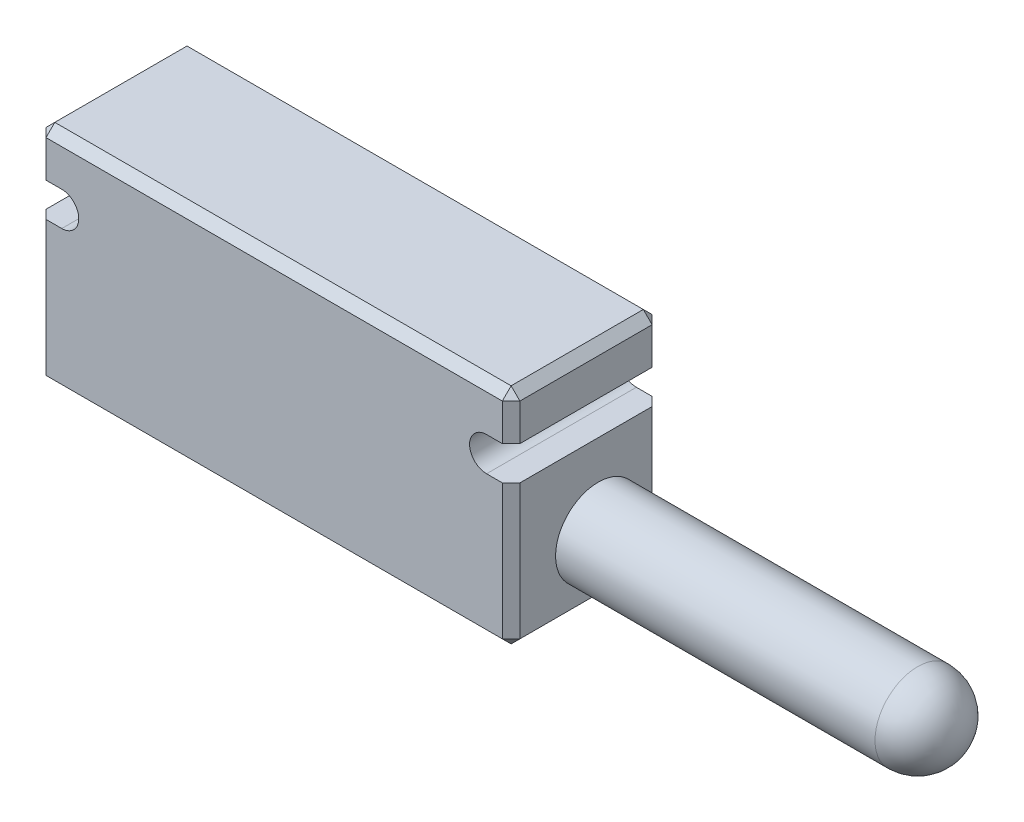
ISO-10303-21;
HEADER;
FILE_DESCRIPTION(('STEP AP214'),'2;1');
FILE_NAME('part.step','',(''),(''),'','','');
FILE_SCHEMA(('AUTOMOTIVE_DESIGN { 1 0 10303 214 1 1 1 1 }'));
ENDSEC;
DATA;
#1=APPLICATION_CONTEXT('core data for automotive mechanical design processes');
#2=APPLICATION_PROTOCOL_DEFINITION('international standard','automotive_design',2000,#1);
#3=PRODUCT_CONTEXT('',#1,'mechanical');
#4=PRODUCT('Part','Part','',(#3));
#5=PRODUCT_RELATED_PRODUCT_CATEGORY('part','',(#4));
#6=PRODUCT_DEFINITION_FORMATION('','',#4);
#7=PRODUCT_DEFINITION_CONTEXT('part definition',#1,'design');
#8=PRODUCT_DEFINITION('design','',#6,#7);
#9=PRODUCT_DEFINITION_SHAPE('','',#8);
#10=(LENGTH_UNIT() NAMED_UNIT(*) SI_UNIT(.MILLI.,.METRE.));
#11=(NAMED_UNIT(*) PLANE_ANGLE_UNIT() SI_UNIT($,.RADIAN.));
#12=(NAMED_UNIT(*) SI_UNIT($,.STERADIAN.) SOLID_ANGLE_UNIT());
#13=UNCERTAINTY_MEASURE_WITH_UNIT(LENGTH_MEASURE(1.E-05),#10,'distance_accuracy_value','');
#14=(GEOMETRIC_REPRESENTATION_CONTEXT(3) GLOBAL_UNCERTAINTY_ASSIGNED_CONTEXT((#13)) GLOBAL_UNIT_ASSIGNED_CONTEXT((#10,
#11,#12)) REPRESENTATION_CONTEXT('',''));
#15=CARTESIAN_POINT('',(0.,0.,0.));
#16=DIRECTION('',(0.,0.,1.));
#17=DIRECTION('',(1.,0.,0.));
#18=AXIS2_PLACEMENT_3D('',#15,#16,#17);
#19=CARTESIAN_POINT('',(-13.46,-6.35,-3.56));
#20=DIRECTION('',(-1.,0.,0.));
#21=DIRECTION('',(0.,0.,1.));
#22=AXIS2_PLACEMENT_3D('',#19,#20,#21);
#23=PLANE('',#22);
#24=DIRECTION('',(0.,0.,1.));
#25=VECTOR('',#24,1.);
#26=CARTESIAN_POINT('',(-13.46,1.825,-3.56));
#27=LINE('',#26,#25);
#28=CARTESIAN_POINT('',(-13.46,1.825,-3.06));
#29=VERTEX_POINT('',#28);
#30=CARTESIAN_POINT('',(-13.46,1.825,4.45));
#31=VERTEX_POINT('',#30);
#32=EDGE_CURVE('E230',#29,#31,#27,.T.);
#33=ORIENTED_EDGE('',*,*,#32,.F.);
#34=DIRECTION('',(0.,-1.,0.));
#35=VECTOR('',#34,1.);
#36=CARTESIAN_POINT('',(-13.46,-6.35,-3.06));
#37=LINE('',#36,#35);
#38=CARTESIAN_POINT('',(-13.46,-5.85,-3.06));
#39=VERTEX_POINT('',#38);
#40=EDGE_CURVE('E53',#29,#39,#37,.T.);
#41=ORIENTED_EDGE('',*,*,#40,.T.);
#42=DIRECTION('',(0.,0.,1.));
#43=VECTOR('',#42,1.);
#44=CARTESIAN_POINT('',(-13.46,-5.85,-3.56));
#45=LINE('',#44,#43);
#46=CARTESIAN_POINT('',(-13.46,-5.85,4.45));
#47=VERTEX_POINT('',#46);
#48=EDGE_CURVE('E57',#39,#47,#45,.T.);
#49=ORIENTED_EDGE('',*,*,#48,.T.);
#50=DIRECTION('',(0.,1.,0.));
#51=VECTOR('',#50,1.);
#52=CARTESIAN_POINT('',(-13.46,-6.35,4.45));
#53=LINE('',#52,#51);
#54=EDGE_CURVE('E328',#47,#31,#53,.T.);
#55=ORIENTED_EDGE('',*,*,#54,.T.);
#56=EDGE_LOOP('',(#33,#41,#49,#55));
#57=FACE_BOUND('',#56,.T.);
#58=ADVANCED_FACE('F36',(#57),#23,.T.);
#59=CARTESIAN_POINT('',(13.46,-6.35,-3.56));
#60=DIRECTION('',(1.,0.,0.));
#61=DIRECTION('',(0.,0.,-1.));
#62=AXIS2_PLACEMENT_3D('',#59,#60,#61);
#63=PLANE('',#62);
#64=DIRECTION('',(0.,0.,1.));
#65=VECTOR('',#64,1.);
#66=CARTESIAN_POINT('',(13.46,3.755,-3.56));
#67=LINE('',#66,#65);
#68=CARTESIAN_POINT('',(13.46,3.755,-3.06));
#69=VERTEX_POINT('',#68);
#70=CARTESIAN_POINT('',(13.46,3.755,4.45));
#71=VERTEX_POINT('',#70);
#72=EDGE_CURVE('E252',#69,#71,#67,.T.);
#73=ORIENTED_EDGE('',*,*,#72,.F.);
#74=DIRECTION('',(0.,1.,0.));
#75=VECTOR('',#74,1.);
#76=CARTESIAN_POINT('',(13.46,6.35,-3.06));
#77=LINE('',#76,#75);
#78=CARTESIAN_POINT('',(13.46,5.85,-3.06));
#79=VERTEX_POINT('',#78);
#80=EDGE_CURVE('E269',#69,#79,#77,.T.);
#81=ORIENTED_EDGE('',*,*,#80,.T.);
#82=DIRECTION('',(0.,0.,1.));
#83=VECTOR('',#82,1.);
#84=CARTESIAN_POINT('',(13.46,5.85,-3.56));
#85=LINE('',#84,#83);
#86=CARTESIAN_POINT('',(13.46,5.85,4.45));
#87=VERTEX_POINT('',#86);
#88=EDGE_CURVE('E266',#79,#87,#85,.T.);
#89=ORIENTED_EDGE('',*,*,#88,.T.);
#90=DIRECTION('',(0.,-1.,0.));
#91=VECTOR('',#90,1.);
#92=CARTESIAN_POINT('',(13.46,-6.35,4.45));
#93=LINE('',#92,#91);
#94=EDGE_CURVE('E264',#87,#71,#93,.T.);
#95=ORIENTED_EDGE('',*,*,#94,.T.);
#96=EDGE_LOOP('',(#73,#81,#89,#95));
#97=FACE_BOUND('',#96,.T.);
#98=ADVANCED_FACE('F466',(#97),#63,.T.);
#99=DIRECTION('',(0.,1.,0.));
#100=VECTOR('',#99,1.);
#101=CARTESIAN_POINT('',(-13.46,-6.35,4.45));
#102=LINE('',#101,#100);
#103=CARTESIAN_POINT('',(-13.46,3.755,4.45));
#104=VERTEX_POINT('',#103);
#105=CARTESIAN_POINT('',(-13.46,5.85,4.45));
#106=VERTEX_POINT('',#105);
#107=EDGE_CURVE('E294',#104,#106,#102,.T.);
#108=ORIENTED_EDGE('',*,*,#107,.T.);
#109=DIRECTION('',(0.,0.,-1.));
#110=VECTOR('',#109,1.);
#111=CARTESIAN_POINT('',(-13.46,5.85,-3.56));
#112=LINE('',#111,#110);
#113=CARTESIAN_POINT('',(-13.46,5.85,-3.56));
#114=VERTEX_POINT('',#113);
#115=EDGE_CURVE('E296',#106,#114,#112,.T.);
#116=ORIENTED_EDGE('',*,*,#115,.T.);
#117=DIRECTION('',(0.,-1.,0.));
#118=VECTOR('',#117,1.);
#119=CARTESIAN_POINT('',(-13.46,-6.35,-3.56));
#120=LINE('',#119,#118);
#121=CARTESIAN_POINT('',(-13.46,3.755,-3.56));
#122=VERTEX_POINT('',#121);
#123=EDGE_CURVE('E229',#114,#122,#120,.T.);
#124=ORIENTED_EDGE('',*,*,#123,.T.);
#125=DIRECTION('',(0.,0.,1.));
#126=VECTOR('',#125,1.);
#127=CARTESIAN_POINT('',(-13.46,3.755,-3.56));
#128=LINE('',#127,#126);
#129=EDGE_CURVE('E202',#122,#104,#128,.T.);
#130=ORIENTED_EDGE('',*,*,#129,.T.);
#131=EDGE_LOOP('',(#108,#116,#124,#130));
#132=FACE_BOUND('',#131,.T.);
#133=ADVANCED_FACE('F472',(#132),#23,.T.);
#134=CARTESIAN_POINT('',(13.46,6.35,-3.56));
#135=DIRECTION('',(0.,1.,0.));
#136=DIRECTION('',(-1.,0.,0.));
#137=AXIS2_PLACEMENT_3D('',#134,#135,#136);
#138=PLANE('',#137);
#139=DIRECTION('',(1.,0.,0.));
#140=VECTOR('',#139,1.);
#141=CARTESIAN_POINT('',(13.46,6.35,4.45));
#142=LINE('',#141,#140);
#143=CARTESIAN_POINT('',(-12.96,6.35,4.45));
#144=VERTEX_POINT('',#143);
#145=CARTESIAN_POINT('',(12.96,6.35,4.45));
#146=VERTEX_POINT('',#145);
#147=EDGE_CURVE('E271',#144,#146,#142,.T.);
#148=ORIENTED_EDGE('',*,*,#147,.T.);
#149=DIRECTION('',(0.,0.,-1.));
#150=VECTOR('',#149,1.);
#151=CARTESIAN_POINT('',(12.96,6.35,-3.56));
#152=LINE('',#151,#150);
#153=CARTESIAN_POINT('',(12.96,6.35,-3.06));
#154=VERTEX_POINT('',#153);
#155=EDGE_CURVE('E277',#146,#154,#152,.T.);
#156=ORIENTED_EDGE('',*,*,#155,.T.);
#157=DIRECTION('',(-1.,0.,0.));
#158=VECTOR('',#157,1.);
#159=CARTESIAN_POINT('',(-13.46,6.35,-3.06));
#160=LINE('',#159,#158);
#161=CARTESIAN_POINT('',(-12.96,6.35,-3.06));
#162=VERTEX_POINT('',#161);
#163=EDGE_CURVE('E275',#154,#162,#160,.T.);
#164=ORIENTED_EDGE('',*,*,#163,.T.);
#165=DIRECTION('',(0.,0.,1.));
#166=VECTOR('',#165,1.);
#167=CARTESIAN_POINT('',(-12.96,6.35,-3.56));
#168=LINE('',#167,#166);
#169=EDGE_CURVE('E273',#162,#144,#168,.T.);
#170=ORIENTED_EDGE('',*,*,#169,.T.);
#171=EDGE_LOOP('',(#148,#156,#164,#170));
#172=FACE_BOUND('',#171,.T.);
#173=ADVANCED_FACE('F463',(#172),#138,.T.);
#174=CARTESIAN_POINT('',(13.46,-2.79,0.));
#175=DIRECTION('',(1.,0.,0.));
#176=DIRECTION('',(0.,0.,-1.));
#177=AXIS2_PLACEMENT_3D('',#174,#175,#176);
#178=CIRCLE('',#177,2.425);
#179=CARTESIAN_POINT('',(13.46,-2.79,-2.425));
#180=VERTEX_POINT('',#179);
#181=EDGE_CURVE('E221',#180,#180,#178,.T.);
#182=ORIENTED_EDGE('',*,*,#181,.F.);
#183=EDGE_LOOP('',(#182));
#184=FACE_BOUND('',#183,.T.);
#185=DIRECTION('',(0.,0.,-1.));
#186=VECTOR('',#185,1.);
#187=CARTESIAN_POINT('',(13.46,-5.85,-3.56));
#188=LINE('',#187,#186);
#189=CARTESIAN_POINT('',(13.46,-5.85,4.45));
#190=VERTEX_POINT('',#189);
#191=CARTESIAN_POINT('',(13.46,-5.85,-3.06));
#192=VERTEX_POINT('',#191);
#193=EDGE_CURVE('E323',#190,#192,#188,.T.);
#194=ORIENTED_EDGE('',*,*,#193,.T.);
#195=DIRECTION('',(0.,1.,0.));
#196=VECTOR('',#195,1.);
#197=CARTESIAN_POINT('',(13.46,1.825,-3.06));
#198=LINE('',#197,#196);
#199=CARTESIAN_POINT('',(13.46,1.825,-3.06));
#200=VERTEX_POINT('',#199);
#201=EDGE_CURVE('E326',#192,#200,#198,.T.);
#202=ORIENTED_EDGE('',*,*,#201,.T.);
#203=DIRECTION('',(0.,0.,1.));
#204=VECTOR('',#203,1.);
#205=CARTESIAN_POINT('',(13.46,1.825,-3.56));
#206=LINE('',#205,#204);
#207=CARTESIAN_POINT('',(13.46,1.825,4.45));
#208=VERTEX_POINT('',#207);
#209=EDGE_CURVE('E255',#200,#208,#206,.T.);
#210=ORIENTED_EDGE('',*,*,#209,.T.);
#211=DIRECTION('',(0.,-1.,0.));
#212=VECTOR('',#211,1.);
#213=CARTESIAN_POINT('',(13.46,-6.35,4.45));
#214=LINE('',#213,#212);
#215=EDGE_CURVE('E321',#208,#190,#214,.T.);
#216=ORIENTED_EDGE('',*,*,#215,.T.);
#217=EDGE_LOOP('',(#194,#202,#210,#216));
#218=FACE_BOUND('',#217,.T.);
#219=ADVANCED_FACE('F461',(#184,#218),#63,.T.);
#220=CARTESIAN_POINT('',(13.46,-6.35,-3.56));
#221=DIRECTION('',(0.,-1.,0.));
#222=DIRECTION('',(1.,0.,0.));
#223=AXIS2_PLACEMENT_3D('',#220,#221,#222);
#224=PLANE('',#223);
#225=DIRECTION('',(1.,0.,0.));
#226=VECTOR('',#225,1.);
#227=CARTESIAN_POINT('',(13.46,-6.35,-3.06));
#228=LINE('',#227,#226);
#229=CARTESIAN_POINT('',(-12.96,-6.35,-3.06));
#230=VERTEX_POINT('',#229);
#231=CARTESIAN_POINT('',(12.96,-6.35,-3.06));
#232=VERTEX_POINT('',#231);
#233=EDGE_CURVE('E316',#230,#232,#228,.T.);
#234=ORIENTED_EDGE('',*,*,#233,.T.);
#235=DIRECTION('',(0.,0.,1.));
#236=VECTOR('',#235,1.);
#237=CARTESIAN_POINT('',(12.96,-6.35,-3.56));
#238=LINE('',#237,#236);
#239=CARTESIAN_POINT('',(12.96,-6.35,4.45));
#240=VERTEX_POINT('',#239);
#241=EDGE_CURVE('E318',#232,#240,#238,.T.);
#242=ORIENTED_EDGE('',*,*,#241,.T.);
#243=DIRECTION('',(-1.,0.,0.));
#244=VECTOR('',#243,1.);
#245=CARTESIAN_POINT('',(13.46,-6.35,4.45));
#246=LINE('',#245,#244);
#247=CARTESIAN_POINT('',(-12.96,-6.35,4.45));
#248=VERTEX_POINT('',#247);
#249=EDGE_CURVE('E312',#240,#248,#246,.T.);
#250=ORIENTED_EDGE('',*,*,#249,.T.);
#251=DIRECTION('',(0.,0.,-1.));
#252=VECTOR('',#251,1.);
#253=CARTESIAN_POINT('',(-12.96,-6.35,-3.56));
#254=LINE('',#253,#252);
#255=EDGE_CURVE('E314',#248,#230,#254,.T.);
#256=ORIENTED_EDGE('',*,*,#255,.T.);
#257=EDGE_LOOP('',(#234,#242,#250,#256));
#258=FACE_BOUND('',#257,.T.);
#259=ADVANCED_FACE('F410',(#258),#224,.T.);
#260=CARTESIAN_POINT('',(0.,0.,-3.56));
#261=DIRECTION('',(0.,0.,1.));
#262=DIRECTION('',(1.,0.,0.));
#263=AXIS2_PLACEMENT_3D('',#260,#261,#262);
#264=PLANE('',#263);
#265=DIRECTION('',(1.,0.,0.));
#266=VECTOR('',#265,1.);
#267=CARTESIAN_POINT('',(13.46,5.85,-3.56));
#268=LINE('',#267,#266);
#269=CARTESIAN_POINT('',(12.96,5.85,-3.56));
#270=VERTEX_POINT('',#269);
#271=EDGE_CURVE('E286',#114,#270,#268,.T.);
#272=ORIENTED_EDGE('',*,*,#271,.T.);
#273=DIRECTION('',(0.,-1.,0.));
#274=VECTOR('',#273,1.);
#275=CARTESIAN_POINT('',(12.96,3.755,-3.56));
#276=LINE('',#275,#274);
#277=CARTESIAN_POINT('',(12.96,3.755,-3.56));
#278=VERTEX_POINT('',#277);
#279=EDGE_CURVE('E288',#270,#278,#276,.T.);
#280=ORIENTED_EDGE('',*,*,#279,.T.);
#281=DIRECTION('',(-1.,0.,0.));
#282=VECTOR('',#281,1.);
#283=CARTESIAN_POINT('',(12.065,3.755,-3.56));
#284=LINE('',#283,#282);
#285=CARTESIAN_POINT('',(12.065,3.755,-3.56));
#286=VERTEX_POINT('',#285);
#287=EDGE_CURVE('E241',#278,#286,#284,.T.);
#288=ORIENTED_EDGE('',*,*,#287,.T.);
#289=CARTESIAN_POINT('',(12.065,2.79,-3.56));
#290=DIRECTION('',(0.,0.,1.));
#291=DIRECTION('',(-1.,0.,0.));
#292=AXIS2_PLACEMENT_3D('',#289,#290,#291);
#293=CIRCLE('',#292,0.965);
#294=CARTESIAN_POINT('',(12.065,1.825,-3.56));
#295=VERTEX_POINT('',#294);
#296=EDGE_CURVE('E234',#286,#295,#293,.T.);
#297=ORIENTED_EDGE('',*,*,#296,.T.);
#298=DIRECTION('',(1.,0.,0.));
#299=VECTOR('',#298,1.);
#300=CARTESIAN_POINT('',(12.065,1.825,-3.56));
#301=LINE('',#300,#299);
#302=CARTESIAN_POINT('',(12.96,1.825,-3.56));
#303=VERTEX_POINT('',#302);
#304=EDGE_CURVE('E237',#295,#303,#301,.T.);
#305=ORIENTED_EDGE('',*,*,#304,.T.);
#306=DIRECTION('',(0.,-1.,0.));
#307=VECTOR('',#306,1.);
#308=CARTESIAN_POINT('',(12.96,-6.35,-3.56));
#309=LINE('',#308,#307);
#310=CARTESIAN_POINT('',(12.96,-5.85,-3.56));
#311=VERTEX_POINT('',#310);
#312=EDGE_CURVE('E282',#303,#311,#309,.T.);
#313=ORIENTED_EDGE('',*,*,#312,.T.);
#314=DIRECTION('',(-1.,0.,0.));
#315=VECTOR('',#314,1.);
#316=CARTESIAN_POINT('',(-13.46,-5.85,-3.56));
#317=LINE('',#316,#315);
#318=CARTESIAN_POINT('',(-12.96,-5.85,-3.56));
#319=VERTEX_POINT('',#318);
#320=EDGE_CURVE('E280',#311,#319,#317,.T.);
#321=ORIENTED_EDGE('',*,*,#320,.T.);
#322=DIRECTION('',(0.,1.,0.));
#323=VECTOR('',#322,1.);
#324=CARTESIAN_POINT('',(-12.96,1.825,-3.56));
#325=LINE('',#324,#323);
#326=CARTESIAN_POINT('',(-12.96,1.825,-3.56));
#327=VERTEX_POINT('',#326);
#328=EDGE_CURVE('E284',#319,#327,#325,.T.);
#329=ORIENTED_EDGE('',*,*,#328,.T.);
#330=DIRECTION('',(1.,0.,0.));
#331=VECTOR('',#330,1.);
#332=CARTESIAN_POINT('',(-12.065,1.825,-3.56));
#333=LINE('',#332,#331);
#334=CARTESIAN_POINT('',(-12.065,1.825,-3.56));
#335=VERTEX_POINT('',#334);
#336=EDGE_CURVE('E203',#327,#335,#333,.T.);
#337=ORIENTED_EDGE('',*,*,#336,.T.);
#338=CARTESIAN_POINT('',(-12.065,2.79,-3.56));
#339=DIRECTION('',(0.,0.,1.));
#340=DIRECTION('',(1.,0.,0.));
#341=AXIS2_PLACEMENT_3D('',#338,#339,#340);
#342=CIRCLE('',#341,0.965);
#343=CARTESIAN_POINT('',(-12.065,3.755,-3.56));
#344=VERTEX_POINT('',#343);
#345=EDGE_CURVE('E196',#335,#344,#342,.T.);
#346=ORIENTED_EDGE('',*,*,#345,.T.);
#347=DIRECTION('',(-1.,0.,0.));
#348=VECTOR('',#347,1.);
#349=CARTESIAN_POINT('',(-12.065,3.755,-3.56));
#350=LINE('',#349,#348);
#351=EDGE_CURVE('E207',#344,#122,#350,.T.);
#352=ORIENTED_EDGE('',*,*,#351,.T.);
#353=ORIENTED_EDGE('',*,*,#123,.F.);
#354=EDGE_LOOP('',(#272,#280,#288,#297,#305,#313,#321,#329,#337,#346,#352,#353));
#355=FACE_BOUND('',#354,.T.);
#356=ADVANCED_FACE('F213',(#355),#264,.F.);
#357=CARTESIAN_POINT('',(0.,0.,4.95));
#358=DIRECTION('',(0.,0.,1.));
#359=DIRECTION('',(1.,0.,0.));
#360=AXIS2_PLACEMENT_3D('',#357,#358,#359);
#361=PLANE('',#360);
#362=DIRECTION('',(-1.,0.,0.));
#363=VECTOR('',#362,1.);
#364=CARTESIAN_POINT('',(12.065,3.755,4.95));
#365=LINE('',#364,#363);
#366=CARTESIAN_POINT('',(12.96,3.755,4.95));
#367=VERTEX_POINT('',#366);
#368=CARTESIAN_POINT('',(12.065,3.755,4.95));
#369=VERTEX_POINT('',#368);
#370=EDGE_CURVE('E238',#367,#369,#365,.T.);
#371=ORIENTED_EDGE('',*,*,#370,.F.);
#372=DIRECTION('',(0.,1.,0.));
#373=VECTOR('',#372,1.);
#374=CARTESIAN_POINT('',(12.96,0.,4.95));
#375=LINE('',#374,#373);
#376=CARTESIAN_POINT('',(12.96,5.85,4.95));
#377=VERTEX_POINT('',#376);
#378=EDGE_CURVE('E308',#367,#377,#375,.T.);
#379=ORIENTED_EDGE('',*,*,#378,.T.);
#380=DIRECTION('',(-1.,0.,0.));
#381=VECTOR('',#380,1.);
#382=CARTESIAN_POINT('',(0.,5.85,4.95));
#383=LINE('',#382,#381);
#384=CARTESIAN_POINT('',(-12.96,5.85,4.95));
#385=VERTEX_POINT('',#384);
#386=EDGE_CURVE('E306',#377,#385,#383,.T.);
#387=ORIENTED_EDGE('',*,*,#386,.T.);
#388=DIRECTION('',(0.,-1.,0.));
#389=VECTOR('',#388,1.);
#390=CARTESIAN_POINT('',(-12.96,0.,4.95));
#391=LINE('',#390,#389);
#392=CARTESIAN_POINT('',(-12.96,3.755,4.95));
#393=VERTEX_POINT('',#392);
#394=EDGE_CURVE('E304',#385,#393,#391,.T.);
#395=ORIENTED_EDGE('',*,*,#394,.T.);
#396=DIRECTION('',(-1.,0.,0.));
#397=VECTOR('',#396,1.);
#398=CARTESIAN_POINT('',(-12.065,3.755,4.95));
#399=LINE('',#398,#397);
#400=CARTESIAN_POINT('',(-12.065,3.755,4.95));
#401=VERTEX_POINT('',#400);
#402=EDGE_CURVE('E218',#401,#393,#399,.T.);
#403=ORIENTED_EDGE('',*,*,#402,.F.);
#404=CARTESIAN_POINT('',(-12.065,2.79,4.95));
#405=DIRECTION('',(0.,0.,1.));
#406=DIRECTION('',(1.,0.,0.));
#407=AXIS2_PLACEMENT_3D('',#404,#405,#406);
#408=CIRCLE('',#407,0.965);
#409=CARTESIAN_POINT('',(-12.065,1.825,4.95));
#410=VERTEX_POINT('',#409);
#411=EDGE_CURVE('E198',#410,#401,#408,.T.);
#412=ORIENTED_EDGE('',*,*,#411,.F.);
#413=DIRECTION('',(1.,0.,0.));
#414=VECTOR('',#413,1.);
#415=CARTESIAN_POINT('',(-12.065,1.825,4.95));
#416=LINE('',#415,#414);
#417=CARTESIAN_POINT('',(-12.96,1.825,4.95));
#418=VERTEX_POINT('',#417);
#419=EDGE_CURVE('E216',#418,#410,#416,.T.);
#420=ORIENTED_EDGE('',*,*,#419,.F.);
#421=DIRECTION('',(0.,-1.,0.));
#422=VECTOR('',#421,1.);
#423=CARTESIAN_POINT('',(-12.96,0.,4.95));
#424=LINE('',#423,#422);
#425=CARTESIAN_POINT('',(-12.96,-5.85,4.95));
#426=VERTEX_POINT('',#425);
#427=EDGE_CURVE('E298',#418,#426,#424,.T.);
#428=ORIENTED_EDGE('',*,*,#427,.T.);
#429=DIRECTION('',(1.,0.,0.));
#430=VECTOR('',#429,1.);
#431=CARTESIAN_POINT('',(0.,-5.85,4.95));
#432=LINE('',#431,#430);
#433=CARTESIAN_POINT('',(12.96,-5.85,4.95));
#434=VERTEX_POINT('',#433);
#435=EDGE_CURVE('E300',#426,#434,#432,.T.);
#436=ORIENTED_EDGE('',*,*,#435,.T.);
#437=DIRECTION('',(0.,1.,0.));
#438=VECTOR('',#437,1.);
#439=CARTESIAN_POINT('',(12.96,0.,4.95));
#440=LINE('',#439,#438);
#441=CARTESIAN_POINT('',(12.96,1.825,4.95));
#442=VERTEX_POINT('',#441);
#443=EDGE_CURVE('E302',#434,#442,#440,.T.);
#444=ORIENTED_EDGE('',*,*,#443,.T.);
#445=DIRECTION('',(1.,0.,0.));
#446=VECTOR('',#445,1.);
#447=CARTESIAN_POINT('',(12.065,1.825,4.95));
#448=LINE('',#447,#446);
#449=CARTESIAN_POINT('',(12.065,1.825,4.95));
#450=VERTEX_POINT('',#449);
#451=EDGE_CURVE('E246',#450,#442,#448,.T.);
#452=ORIENTED_EDGE('',*,*,#451,.F.);
#453=CARTESIAN_POINT('',(12.065,2.79,4.95));
#454=DIRECTION('',(0.,0.,1.));
#455=DIRECTION('',(-1.,0.,0.));
#456=AXIS2_PLACEMENT_3D('',#453,#454,#455);
#457=CIRCLE('',#456,0.965);
#458=EDGE_CURVE('E244',#369,#450,#457,.T.);
#459=ORIENTED_EDGE('',*,*,#458,.F.);
#460=EDGE_LOOP('',(#371,#379,#387,#395,#403,#412,#420,#428,#436,#444,#452,#459));
#461=FACE_BOUND('',#460,.T.);
#462=ADVANCED_FACE('F451',(#461),#361,.T.);
#463=CARTESIAN_POINT('',(12.065,2.79,-3.56));
#464=DIRECTION('',(0.,0.,1.));
#465=DIRECTION('',(1.,0.,0.));
#466=AXIS2_PLACEMENT_3D('',#463,#464,#465);
#467=CYLINDRICAL_SURFACE('',#466,0.965);
#468=ORIENTED_EDGE('',*,*,#458,.T.);
#469=DIRECTION('',(0.,0.,1.));
#470=VECTOR('',#469,1.);
#471=CARTESIAN_POINT('',(12.065,1.825,-3.56));
#472=LINE('',#471,#470);
#473=EDGE_CURVE('E243',#295,#450,#472,.T.);
#474=ORIENTED_EDGE('',*,*,#473,.F.);
#475=ORIENTED_EDGE('',*,*,#296,.F.);
#476=DIRECTION('',(0.,0.,1.));
#477=VECTOR('',#476,1.);
#478=CARTESIAN_POINT('',(12.065,3.755,-3.56));
#479=LINE('',#478,#477);
#480=EDGE_CURVE('E225',#286,#369,#479,.T.);
#481=ORIENTED_EDGE('',*,*,#480,.T.);
#482=EDGE_LOOP('',(#468,#474,#475,#481));
#483=FACE_BOUND('',#482,.T.);
#484=ADVANCED_FACE('F534',(#483),#467,.F.);
#485=CARTESIAN_POINT('',(12.065,3.755,-3.56));
#486=DIRECTION('',(0.,1.,0.));
#487=DIRECTION('',(-1.,0.,0.));
#488=AXIS2_PLACEMENT_3D('',#485,#486,#487);
#489=PLANE('',#488);
#490=ORIENTED_EDGE('',*,*,#287,.F.);
#491=DIRECTION('',(0.707106781186548,0.,0.707106781186548));
#492=VECTOR('',#491,1.);
#493=CARTESIAN_POINT('',(13.46,3.755,-3.06));
#494=LINE('',#493,#492);
#495=EDGE_CURVE('E292',#278,#69,#494,.T.);
#496=ORIENTED_EDGE('',*,*,#495,.T.);
#497=ORIENTED_EDGE('',*,*,#72,.T.);
#498=DIRECTION('',(0.707106781186548,0.,-0.707106781186548));
#499=VECTOR('',#498,1.);
#500=CARTESIAN_POINT('',(12.96,3.755,4.95));
#501=LINE('',#500,#499);
#502=EDGE_CURVE('E290',#71,#367,#501,.F.);
#503=ORIENTED_EDGE('',*,*,#502,.T.);
#504=ORIENTED_EDGE('',*,*,#370,.T.);
#505=ORIENTED_EDGE('',*,*,#480,.F.);
#506=EDGE_LOOP('',(#490,#496,#497,#503,#504,#505));
#507=FACE_BOUND('',#506,.T.);
#508=ADVANCED_FACE('F523',(#507),#489,.F.);
#509=CARTESIAN_POINT('',(12.065,1.825,-3.56));
#510=DIRECTION('',(0.,-1.,0.));
#511=DIRECTION('',(0.,0.,-1.));
#512=AXIS2_PLACEMENT_3D('',#509,#510,#511);
#513=PLANE('',#512);
#514=ORIENTED_EDGE('',*,*,#209,.F.);
#515=DIRECTION('',(-0.707106781186548,0.,-0.707106781186548));
#516=VECTOR('',#515,1.);
#517=CARTESIAN_POINT('',(13.46,1.825,-3.06));
#518=LINE('',#517,#516);
#519=EDGE_CURVE('E11',#200,#303,#518,.T.);
#520=ORIENTED_EDGE('',*,*,#519,.T.);
#521=ORIENTED_EDGE('',*,*,#304,.F.);
#522=ORIENTED_EDGE('',*,*,#473,.T.);
#523=ORIENTED_EDGE('',*,*,#451,.T.);
#524=DIRECTION('',(-0.707106781186548,0.,0.707106781186548));
#525=VECTOR('',#524,1.);
#526=CARTESIAN_POINT('',(12.96,1.825,4.95));
#527=LINE('',#526,#525);
#528=EDGE_CURVE('E45',#442,#208,#527,.F.);
#529=ORIENTED_EDGE('',*,*,#528,.T.);
#530=EDGE_LOOP('',(#514,#520,#521,#522,#523,#529));
#531=FACE_BOUND('',#530,.T.);
#532=ADVANCED_FACE('F459',(#531),#513,.F.);
#533=CARTESIAN_POINT('',(-12.065,2.79,-3.56));
#534=DIRECTION('',(0.,0.,1.));
#535=DIRECTION('',(1.,0.,0.));
#536=AXIS2_PLACEMENT_3D('',#533,#534,#535);
#537=CYLINDRICAL_SURFACE('',#536,0.965);
#538=ORIENTED_EDGE('',*,*,#411,.T.);
#539=DIRECTION('',(0.,0.,1.));
#540=VECTOR('',#539,1.);
#541=CARTESIAN_POINT('',(-12.065,3.755,-3.56));
#542=LINE('',#541,#540);
#543=EDGE_CURVE('E191',#344,#401,#542,.T.);
#544=ORIENTED_EDGE('',*,*,#543,.F.);
#545=ORIENTED_EDGE('',*,*,#345,.F.);
#546=DIRECTION('',(0.,0.,1.));
#547=VECTOR('',#546,1.);
#548=CARTESIAN_POINT('',(-12.065,1.825,-3.56));
#549=LINE('',#548,#547);
#550=EDGE_CURVE('E227',#335,#410,#549,.T.);
#551=ORIENTED_EDGE('',*,*,#550,.T.);
#552=EDGE_LOOP('',(#538,#544,#545,#551));
#553=FACE_BOUND('',#552,.T.);
#554=ADVANCED_FACE('F193',(#553),#537,.F.);
#555=CARTESIAN_POINT('',(-12.065,1.825,-3.56));
#556=DIRECTION('',(0.,-1.,0.));
#557=DIRECTION('',(0.,0.,-1.));
#558=AXIS2_PLACEMENT_3D('',#555,#556,#557);
#559=PLANE('',#558);
#560=ORIENTED_EDGE('',*,*,#336,.F.);
#561=DIRECTION('',(-0.707106781186548,0.,0.707106781186548));
#562=VECTOR('',#561,1.);
#563=CARTESIAN_POINT('',(-13.46,1.825,-3.06));
#564=LINE('',#563,#562);
#565=EDGE_CURVE('E334',#327,#29,#564,.T.);
#566=ORIENTED_EDGE('',*,*,#565,.T.);
#567=ORIENTED_EDGE('',*,*,#32,.T.);
#568=DIRECTION('',(-0.707106781186548,0.,-0.707106781186548));
#569=VECTOR('',#568,1.);
#570=CARTESIAN_POINT('',(-12.96,1.825,4.95));
#571=LINE('',#570,#569);
#572=EDGE_CURVE('E332',#31,#418,#571,.F.);
#573=ORIENTED_EDGE('',*,*,#572,.T.);
#574=ORIENTED_EDGE('',*,*,#419,.T.);
#575=ORIENTED_EDGE('',*,*,#550,.F.);
#576=EDGE_LOOP('',(#560,#566,#567,#573,#574,#575));
#577=FACE_BOUND('',#576,.T.);
#578=ADVANCED_FACE('F427',(#577),#559,.F.);
#579=CARTESIAN_POINT('',(-12.065,3.755,-3.56));
#580=DIRECTION('',(0.,1.,0.));
#581=DIRECTION('',(-1.,0.,0.));
#582=AXIS2_PLACEMENT_3D('',#579,#580,#581);
#583=PLANE('',#582);
#584=ORIENTED_EDGE('',*,*,#402,.T.);
#585=DIRECTION('',(0.707106781186548,0.,0.707106781186548));
#586=VECTOR('',#585,1.);
#587=CARTESIAN_POINT('',(-12.96,3.755,4.95));
#588=LINE('',#587,#586);
#589=EDGE_CURVE('E310',#393,#104,#588,.F.);
#590=ORIENTED_EDGE('',*,*,#589,.T.);
#591=ORIENTED_EDGE('',*,*,#129,.F.);
#592=ORIENTED_EDGE('',*,*,#351,.F.);
#593=ORIENTED_EDGE('',*,*,#543,.T.);
#594=EDGE_LOOP('',(#584,#590,#591,#592,#593));
#595=FACE_BOUND('',#594,.T.);
#596=ADVANCED_FACE('F208',(#595),#583,.F.);
#597=CARTESIAN_POINT('',(34.03,-2.79,0.));
#598=DIRECTION('',(-1.,0.,0.));
#599=DIRECTION('',(0.,0.,1.));
#600=AXIS2_PLACEMENT_3D('',#597,#598,#599);
#601=CYLINDRICAL_SURFACE('',#600,2.425);
#602=CARTESIAN_POINT('',(31.605,-2.79,0.));
#603=DIRECTION('',(-1.,0.,0.));
#604=DIRECTION('',(0.,0.,1.));
#605=AXIS2_PLACEMENT_3D('',#602,#603,#604);
#606=CIRCLE('',#605,2.425);
#607=CARTESIAN_POINT('',(31.605,-2.79,2.425));
#608=VERTEX_POINT('',#607);
#609=EDGE_CURVE('E261',#608,#608,#606,.T.);
#610=ORIENTED_EDGE('',*,*,#609,.T.);
#611=EDGE_LOOP('',(#610));
#612=FACE_BOUND('',#611,.T.);
#613=ORIENTED_EDGE('',*,*,#181,.T.);
#614=EDGE_LOOP('',(#613));
#615=FACE_BOUND('',#614,.T.);
#616=ADVANCED_FACE('F589',(#612,#615),#601,.T.);
#617=CARTESIAN_POINT('',(31.605,-2.79,0.));
#618=DIRECTION('',(1.,0.,0.));
#619=DIRECTION('',(0.,0.,-1.));
#620=AXIS2_PLACEMENT_3D('',#617,#618,#619);
#621=SPHERICAL_SURFACE('',#620,2.425);
#622=ORIENTED_EDGE('',*,*,#609,.F.);
#623=EDGE_LOOP('',(#622));
#624=FACE_BOUND('',#623,.T.);
#625=ADVANCED_FACE('F600',(#624),#621,.T.);
#626=CARTESIAN_POINT('',(-12.96,0.,4.95));
#627=DIRECTION('',(0.707106781186547,0.,-0.707106781186547));
#628=DIRECTION('',(0.,-1.,0.));
#629=AXIS2_PLACEMENT_3D('',#626,#627,#628);
#630=PLANE('',#629);
#631=ORIENTED_EDGE('',*,*,#589,.F.);
#632=ORIENTED_EDGE('',*,*,#394,.F.);
#633=DIRECTION('',(-0.707106781186547,0.,-0.707106781186547));
#634=VECTOR('',#633,1.);
#635=CARTESIAN_POINT('',(-13.21,5.85,4.7));
#636=LINE('',#635,#634);
#637=EDGE_CURVE('E362',#106,#385,#636,.F.);
#638=ORIENTED_EDGE('',*,*,#637,.F.);
#639=ORIENTED_EDGE('',*,*,#107,.F.);
#640=EDGE_LOOP('',(#631,#632,#638,#639));
#641=FACE_BOUND('',#640,.T.);
#642=ADVANCED_FACE('F500',(#641),#630,.F.);
#643=CARTESIAN_POINT('',(-12.96,6.35,-3.56));
#644=DIRECTION('',(0.707106781186547,-0.707106781186547,0.));
#645=DIRECTION('',(0.,0.,1.));
#646=AXIS2_PLACEMENT_3D('',#643,#644,#645);
#647=PLANE('',#646);
#648=DIRECTION('',(0.577350269189626,0.577350269189626,0.577350269189625));
#649=VECTOR('',#648,1.);
#650=CARTESIAN_POINT('',(-13.1266666666667,6.18333333333333,-3.22666666666667));
#651=LINE('',#650,#649);
#652=EDGE_CURVE('E356',#114,#162,#651,.T.);
#653=ORIENTED_EDGE('',*,*,#652,.F.);
#654=ORIENTED_EDGE('',*,*,#115,.F.);
#655=DIRECTION('',(0.707106781186548,0.707106781186548,0.));
#656=VECTOR('',#655,1.);
#657=CARTESIAN_POINT('',(-12.96,6.35,4.45));
#658=LINE('',#657,#656);
#659=EDGE_CURVE('E359',#144,#106,#658,.F.);
#660=ORIENTED_EDGE('',*,*,#659,.F.);
#661=ORIENTED_EDGE('',*,*,#169,.F.);
#662=EDGE_LOOP('',(#653,#654,#660,#661));
#663=FACE_BOUND('',#662,.T.);
#664=ADVANCED_FACE('F495',(#663),#647,.F.);
#665=CARTESIAN_POINT('',(-12.96,6.35,4.45));
#666=DIRECTION('',(-0.577350269189625,0.577350269189625,0.577350269189626));
#667=DIRECTION('',(0.707106781186548,0.,0.707106781186547));
#668=AXIS2_PLACEMENT_3D('',#665,#666,#667);
#669=PLANE('',#668);
#670=ORIENTED_EDGE('',*,*,#659,.T.);
#671=ORIENTED_EDGE('',*,*,#637,.T.);
#672=DIRECTION('',(0.,-0.707106781186548,0.707106781186547));
#673=VECTOR('',#672,1.);
#674=CARTESIAN_POINT('',(-12.96,6.35,4.45));
#675=LINE('',#674,#673);
#676=EDGE_CURVE('E353',#144,#385,#675,.T.);
#677=ORIENTED_EDGE('',*,*,#676,.F.);
#678=EDGE_LOOP('',(#670,#671,#677));
#679=FACE_BOUND('',#678,.T.);
#680=ADVANCED_FACE('F502',(#679),#669,.T.);
#681=CARTESIAN_POINT('',(13.46,6.35,-3.06));
#682=DIRECTION('',(0.,0.707106781186547,-0.707106781186548));
#683=DIRECTION('',(1.,0.,0.));
#684=AXIS2_PLACEMENT_3D('',#681,#682,#683);
#685=PLANE('',#684);
#686=ORIENTED_EDGE('',*,*,#652,.T.);
#687=ORIENTED_EDGE('',*,*,#163,.F.);
#688=DIRECTION('',(0.,0.707106781186548,0.707106781186547));
#689=VECTOR('',#688,1.);
#690=CARTESIAN_POINT('',(12.96,6.35,-3.06));
#691=LINE('',#690,#689);
#692=EDGE_CURVE('E350',#270,#154,#691,.T.);
#693=ORIENTED_EDGE('',*,*,#692,.F.);
#694=ORIENTED_EDGE('',*,*,#271,.F.);
#695=EDGE_LOOP('',(#686,#687,#693,#694));
#696=FACE_BOUND('',#695,.T.);
#697=ADVANCED_FACE('F511',(#696),#685,.T.);
#698=CARTESIAN_POINT('',(13.46,-6.35,-3.06));
#699=DIRECTION('',(0.707106781186547,0.,-0.707106781186547));
#700=DIRECTION('',(0.,-1.,0.));
#701=AXIS2_PLACEMENT_3D('',#698,#699,#700);
#702=PLANE('',#701);
#703=ORIENTED_EDGE('',*,*,#495,.F.);
#704=ORIENTED_EDGE('',*,*,#279,.F.);
#705=DIRECTION('',(-0.707106781186548,0.,-0.707106781186548));
#706=VECTOR('',#705,1.);
#707=CARTESIAN_POINT('',(13.21,5.85,-3.31));
#708=LINE('',#707,#706);
#709=EDGE_CURVE('E347',#79,#270,#708,.T.);
#710=ORIENTED_EDGE('',*,*,#709,.F.);
#711=ORIENTED_EDGE('',*,*,#80,.F.);
#712=EDGE_LOOP('',(#703,#704,#710,#711));
#713=FACE_BOUND('',#712,.T.);
#714=ADVANCED_FACE('F518',(#713),#702,.T.);
#715=CARTESIAN_POINT('',(12.96,0.,4.95));
#716=DIRECTION('',(-0.707106781186547,0.,-0.707106781186547));
#717=DIRECTION('',(0.,1.,0.));
#718=AXIS2_PLACEMENT_3D('',#715,#716,#717);
#719=PLANE('',#718);
#720=ORIENTED_EDGE('',*,*,#502,.F.);
#721=ORIENTED_EDGE('',*,*,#94,.F.);
#722=DIRECTION('',(-0.707106781186548,0.,0.707106781186548));
#723=VECTOR('',#722,1.);
#724=CARTESIAN_POINT('',(13.46,5.85,4.45));
#725=LINE('',#724,#723);
#726=EDGE_CURVE('E344',#377,#87,#725,.F.);
#727=ORIENTED_EDGE('',*,*,#726,.F.);
#728=ORIENTED_EDGE('',*,*,#378,.F.);
#729=EDGE_LOOP('',(#720,#721,#727,#728));
#730=FACE_BOUND('',#729,.T.);
#731=ADVANCED_FACE('F530',(#730),#719,.F.);
#732=CARTESIAN_POINT('',(0.,5.85,4.95));
#733=DIRECTION('',(0.,-0.707106781186547,-0.707106781186548));
#734=DIRECTION('',(-1.,0.,0.));
#735=AXIS2_PLACEMENT_3D('',#732,#733,#734);
#736=PLANE('',#735);
#737=ORIENTED_EDGE('',*,*,#676,.T.);
#738=ORIENTED_EDGE('',*,*,#386,.F.);
#739=DIRECTION('',(0.,0.707106781186548,-0.707106781186547));
#740=VECTOR('',#739,1.);
#741=CARTESIAN_POINT('',(12.96,6.1,4.7));
#742=LINE('',#741,#740);
#743=EDGE_CURVE('E341',#146,#377,#742,.F.);
#744=ORIENTED_EDGE('',*,*,#743,.F.);
#745=ORIENTED_EDGE('',*,*,#147,.F.);
#746=EDGE_LOOP('',(#737,#738,#744,#745));
#747=FACE_BOUND('',#746,.T.);
#748=ADVANCED_FACE('F507',(#747),#736,.F.);
#749=CARTESIAN_POINT('',(12.96,6.35,-3.06));
#750=DIRECTION('',(0.577350269189625,0.577350269189626,-0.577350269189627));
#751=DIRECTION('',(0.,0.707106781186548,0.707106781186547));
#752=AXIS2_PLACEMENT_3D('',#749,#750,#751);
#753=PLANE('',#752);
#754=ORIENTED_EDGE('',*,*,#709,.T.);
#755=ORIENTED_EDGE('',*,*,#692,.T.);
#756=DIRECTION('',(-0.707106781186548,0.707106781186547,0.));
#757=VECTOR('',#756,1.);
#758=CARTESIAN_POINT('',(12.96,6.35,-3.06));
#759=LINE('',#758,#757);
#760=EDGE_CURVE('E339',#79,#154,#759,.T.);
#761=ORIENTED_EDGE('',*,*,#760,.F.);
#762=EDGE_LOOP('',(#754,#755,#761));
#763=FACE_BOUND('',#762,.T.);
#764=ADVANCED_FACE('F651',(#763),#753,.T.);
#765=CARTESIAN_POINT('',(13.46,5.85,4.45));
#766=DIRECTION('',(0.577350269189625,0.577350269189626,0.577350269189627));
#767=DIRECTION('',(0.,-0.707106781186548,0.707106781186547));
#768=AXIS2_PLACEMENT_3D('',#765,#766,#767);
#769=PLANE('',#768);
#770=ORIENTED_EDGE('',*,*,#743,.T.);
#771=ORIENTED_EDGE('',*,*,#726,.T.);
#772=DIRECTION('',(0.707106781186548,-0.707106781186547,0.));
#773=VECTOR('',#772,1.);
#774=CARTESIAN_POINT('',(13.46,5.85,4.45));
#775=LINE('',#774,#773);
#776=EDGE_CURVE('E337',#146,#87,#775,.T.);
#777=ORIENTED_EDGE('',*,*,#776,.F.);
#778=EDGE_LOOP('',(#770,#771,#777));
#779=FACE_BOUND('',#778,.T.);
#780=ADVANCED_FACE('F660',(#779),#769,.T.);
#781=CARTESIAN_POINT('',(13.46,5.85,-3.56));
#782=DIRECTION('',(-0.707106781186547,-0.707106781186548,0.));
#783=DIRECTION('',(0.,0.,1.));
#784=AXIS2_PLACEMENT_3D('',#781,#782,#783);
#785=PLANE('',#784);
#786=ORIENTED_EDGE('',*,*,#760,.T.);
#787=ORIENTED_EDGE('',*,*,#155,.F.);
#788=ORIENTED_EDGE('',*,*,#776,.T.);
#789=ORIENTED_EDGE('',*,*,#88,.F.);
#790=EDGE_LOOP('',(#786,#787,#788,#789));
#791=FACE_BOUND('',#790,.T.);
#792=ADVANCED_FACE('F670',(#791),#785,.F.);
#793=CARTESIAN_POINT('',(-13.46,-6.35,-3.06));
#794=DIRECTION('',(-0.707106781186547,0.,-0.707106781186547));
#795=DIRECTION('',(0.,1.,0.));
#796=AXIS2_PLACEMENT_3D('',#793,#794,#795);
#797=PLANE('',#796);
#798=ORIENTED_EDGE('',*,*,#565,.F.);
#799=ORIENTED_EDGE('',*,*,#328,.F.);
#800=DIRECTION('',(0.707106781186547,0.,-0.707106781186547));
#801=VECTOR('',#800,1.);
#802=CARTESIAN_POINT('',(-13.46,-5.85,-3.06));
#803=LINE('',#802,#801);
#804=EDGE_CURVE('E40',#39,#319,#803,.T.);
#805=ORIENTED_EDGE('',*,*,#804,.F.);
#806=ORIENTED_EDGE('',*,*,#40,.F.);
#807=EDGE_LOOP('',(#798,#799,#805,#806));
#808=FACE_BOUND('',#807,.T.);
#809=ADVANCED_FACE('F38',(#808),#797,.T.);
#810=CARTESIAN_POINT('',(-13.46,-5.85,-3.56));
#811=DIRECTION('',(0.707106781186547,0.707106781186547,0.));
#812=DIRECTION('',(0.,0.,1.));
#813=AXIS2_PLACEMENT_3D('',#810,#811,#812);
#814=PLANE('',#813);
#815=DIRECTION('',(-0.707106781186547,0.707106781186547,0.));
#816=VECTOR('',#815,1.);
#817=CARTESIAN_POINT('',(-13.46,-5.85,4.45));
#818=LINE('',#817,#816);
#819=EDGE_CURVE('E390',#47,#248,#818,.F.);
#820=ORIENTED_EDGE('',*,*,#819,.F.);
#821=ORIENTED_EDGE('',*,*,#48,.F.);
#822=DIRECTION('',(0.707106781186547,-0.707106781186547,0.));
#823=VECTOR('',#822,1.);
#824=CARTESIAN_POINT('',(-13.46,-5.85,-3.06));
#825=LINE('',#824,#823);
#826=EDGE_CURVE('E392',#230,#39,#825,.F.);
#827=ORIENTED_EDGE('',*,*,#826,.F.);
#828=ORIENTED_EDGE('',*,*,#255,.F.);
#829=EDGE_LOOP('',(#820,#821,#827,#828));
#830=FACE_BOUND('',#829,.T.);
#831=ADVANCED_FACE('F416',(#830),#814,.F.);
#832=CARTESIAN_POINT('',(-12.96,0.,4.95));
#833=DIRECTION('',(0.707106781186547,0.,-0.707106781186547));
#834=DIRECTION('',(0.,-1.,0.));
#835=AXIS2_PLACEMENT_3D('',#832,#833,#834);
#836=PLANE('',#835);
#837=ORIENTED_EDGE('',*,*,#572,.F.);
#838=ORIENTED_EDGE('',*,*,#54,.F.);
#839=DIRECTION('',(0.707106781186547,0.,0.707106781186547));
#840=VECTOR('',#839,1.);
#841=CARTESIAN_POINT('',(-13.46,-5.85,4.45));
#842=LINE('',#841,#840);
#843=EDGE_CURVE('E387',#426,#47,#842,.F.);
#844=ORIENTED_EDGE('',*,*,#843,.F.);
#845=ORIENTED_EDGE('',*,*,#427,.F.);
#846=EDGE_LOOP('',(#837,#838,#844,#845));
#847=FACE_BOUND('',#846,.T.);
#848=ADVANCED_FACE('F425',(#847),#836,.F.);
#849=CARTESIAN_POINT('',(-13.46,-5.85,-3.06));
#850=DIRECTION('',(-0.577350269189626,-0.577350269189626,-0.577350269189626));
#851=DIRECTION('',(-0.707106781186547,0.,0.707106781186547));
#852=AXIS2_PLACEMENT_3D('',#849,#850,#851);
#853=PLANE('',#852);
#854=ORIENTED_EDGE('',*,*,#826,.T.);
#855=ORIENTED_EDGE('',*,*,#804,.T.);
#856=DIRECTION('',(0.,-0.707106781186548,0.707106781186548));
#857=VECTOR('',#856,1.);
#858=CARTESIAN_POINT('',(-12.96,-6.1,-3.31));
#859=LINE('',#858,#857);
#860=EDGE_CURVE('E384',#230,#319,#859,.F.);
#861=ORIENTED_EDGE('',*,*,#860,.F.);
#862=EDGE_LOOP('',(#854,#855,#861));
#863=FACE_BOUND('',#862,.T.);
#864=ADVANCED_FACE('F399',(#863),#853,.T.);
#865=CARTESIAN_POINT('',(-13.46,-5.85,4.45));
#866=DIRECTION('',(-0.577350269189626,-0.577350269189626,0.577350269189626));
#867=DIRECTION('',(0.707106781186547,0.,0.707106781186547));
#868=AXIS2_PLACEMENT_3D('',#865,#866,#867);
#869=PLANE('',#868);
#870=ORIENTED_EDGE('',*,*,#843,.T.);
#871=ORIENTED_EDGE('',*,*,#819,.T.);
#872=DIRECTION('',(0.,-0.707106781186548,-0.707106781186548));
#873=VECTOR('',#872,1.);
#874=CARTESIAN_POINT('',(-12.96,-6.1,4.7));
#875=LINE('',#874,#873);
#876=EDGE_CURVE('E381',#426,#248,#875,.T.);
#877=ORIENTED_EDGE('',*,*,#876,.F.);
#878=EDGE_LOOP('',(#870,#871,#877));
#879=FACE_BOUND('',#878,.T.);
#880=ADVANCED_FACE('F420',(#879),#869,.T.);
#881=CARTESIAN_POINT('',(13.46,-6.35,-3.06));
#882=DIRECTION('',(0.707106781186547,0.,-0.707106781186547));
#883=DIRECTION('',(0.,-1.,0.));
#884=AXIS2_PLACEMENT_3D('',#881,#882,#883);
#885=PLANE('',#884);
#886=ORIENTED_EDGE('',*,*,#519,.F.);
#887=ORIENTED_EDGE('',*,*,#201,.F.);
#888=DIRECTION('',(0.707106781186547,0.,0.707106781186547));
#889=VECTOR('',#888,1.);
#890=CARTESIAN_POINT('',(13.46,-5.85,-3.06));
#891=LINE('',#890,#889);
#892=EDGE_CURVE('E378',#311,#192,#891,.T.);
#893=ORIENTED_EDGE('',*,*,#892,.F.);
#894=ORIENTED_EDGE('',*,*,#312,.F.);
#895=EDGE_LOOP('',(#886,#887,#893,#894));
#896=FACE_BOUND('',#895,.T.);
#897=ADVANCED_FACE('F434',(#896),#885,.T.);
#898=CARTESIAN_POINT('',(13.46,-6.35,-3.06));
#899=DIRECTION('',(0.,-0.707106781186547,-0.707106781186547));
#900=DIRECTION('',(-1.,0.,0.));
#901=AXIS2_PLACEMENT_3D('',#898,#899,#900);
#902=PLANE('',#901);
#903=ORIENTED_EDGE('',*,*,#860,.T.);
#904=ORIENTED_EDGE('',*,*,#320,.F.);
#905=DIRECTION('',(0.,0.707106781186547,-0.707106781186547));
#906=VECTOR('',#905,1.);
#907=CARTESIAN_POINT('',(12.96,-6.1,-3.31));
#908=LINE('',#907,#906);
#909=EDGE_CURVE('E375',#232,#311,#908,.T.);
#910=ORIENTED_EDGE('',*,*,#909,.F.);
#911=ORIENTED_EDGE('',*,*,#233,.F.);
#912=EDGE_LOOP('',(#903,#904,#910,#911));
#913=FACE_BOUND('',#912,.T.);
#914=ADVANCED_FACE('F405',(#913),#902,.T.);
#915=CARTESIAN_POINT('',(0.,-5.85,4.95));
#916=DIRECTION('',(0.,0.707106781186547,-0.707106781186547));
#917=DIRECTION('',(1.,0.,0.));
#918=AXIS2_PLACEMENT_3D('',#915,#916,#917);
#919=PLANE('',#918);
#920=ORIENTED_EDGE('',*,*,#876,.T.);
#921=ORIENTED_EDGE('',*,*,#249,.F.);
#922=DIRECTION('',(0.,0.707106781186547,0.707106781186547));
#923=VECTOR('',#922,1.);
#924=CARTESIAN_POINT('',(12.96,-6.35,4.45));
#925=LINE('',#924,#923);
#926=EDGE_CURVE('E372',#434,#240,#925,.F.);
#927=ORIENTED_EDGE('',*,*,#926,.F.);
#928=ORIENTED_EDGE('',*,*,#435,.F.);
#929=EDGE_LOOP('',(#920,#921,#927,#928));
#930=FACE_BOUND('',#929,.T.);
#931=ADVANCED_FACE('F447',(#930),#919,.F.);
#932=CARTESIAN_POINT('',(12.96,0.,4.95));
#933=DIRECTION('',(-0.707106781186547,0.,-0.707106781186547));
#934=DIRECTION('',(0.,1.,0.));
#935=AXIS2_PLACEMENT_3D('',#932,#933,#934);
#936=PLANE('',#935);
#937=ORIENTED_EDGE('',*,*,#528,.F.);
#938=ORIENTED_EDGE('',*,*,#443,.F.);
#939=DIRECTION('',(0.707106781186547,0.,-0.707106781186547));
#940=VECTOR('',#939,1.);
#941=CARTESIAN_POINT('',(13.21,-5.85,4.7));
#942=LINE('',#941,#940);
#943=EDGE_CURVE('E369',#190,#434,#942,.F.);
#944=ORIENTED_EDGE('',*,*,#943,.F.);
#945=ORIENTED_EDGE('',*,*,#215,.F.);
#946=EDGE_LOOP('',(#937,#938,#944,#945));
#947=FACE_BOUND('',#946,.T.);
#948=ADVANCED_FACE('F455',(#947),#936,.F.);
#949=CARTESIAN_POINT('',(13.46,-5.85,-3.06));
#950=DIRECTION('',(0.577350269189626,-0.577350269189626,-0.577350269189626));
#951=DIRECTION('',(-0.707106781186547,0.,-0.707106781186547));
#952=AXIS2_PLACEMENT_3D('',#949,#950,#951);
#953=PLANE('',#952);
#954=ORIENTED_EDGE('',*,*,#909,.T.);
#955=ORIENTED_EDGE('',*,*,#892,.T.);
#956=DIRECTION('',(0.707106781186547,0.707106781186547,0.));
#957=VECTOR('',#956,1.);
#958=CARTESIAN_POINT('',(13.46,-5.85,-3.06));
#959=LINE('',#958,#957);
#960=EDGE_CURVE('E367',#232,#192,#959,.T.);
#961=ORIENTED_EDGE('',*,*,#960,.F.);
#962=EDGE_LOOP('',(#954,#955,#961));
#963=FACE_BOUND('',#962,.T.);
#964=ADVANCED_FACE('F437',(#963),#953,.T.);
#965=CARTESIAN_POINT('',(12.96,-6.35,4.45));
#966=DIRECTION('',(0.577350269189626,-0.577350269189626,0.577350269189626));
#967=DIRECTION('',(0.707106781186547,0.,-0.707106781186547));
#968=AXIS2_PLACEMENT_3D('',#965,#966,#967);
#969=PLANE('',#968);
#970=ORIENTED_EDGE('',*,*,#943,.T.);
#971=ORIENTED_EDGE('',*,*,#926,.T.);
#972=DIRECTION('',(-0.707106781186547,-0.707106781186547,0.));
#973=VECTOR('',#972,1.);
#974=CARTESIAN_POINT('',(12.96,-6.35,4.45));
#975=LINE('',#974,#973);
#976=EDGE_CURVE('E365',#190,#240,#975,.T.);
#977=ORIENTED_EDGE('',*,*,#976,.F.);
#978=EDGE_LOOP('',(#970,#971,#977));
#979=FACE_BOUND('',#978,.T.);
#980=ADVANCED_FACE('F444',(#979),#969,.T.);
#981=CARTESIAN_POINT('',(12.96,-6.35,-3.56));
#982=DIRECTION('',(-0.707106781186547,0.707106781186547,0.));
#983=DIRECTION('',(0.,0.,1.));
#984=AXIS2_PLACEMENT_3D('',#981,#982,#983);
#985=PLANE('',#984);
#986=ORIENTED_EDGE('',*,*,#960,.T.);
#987=ORIENTED_EDGE('',*,*,#193,.F.);
#988=ORIENTED_EDGE('',*,*,#976,.T.);
#989=ORIENTED_EDGE('',*,*,#241,.F.);
#990=EDGE_LOOP('',(#986,#987,#988,#989));
#991=FACE_BOUND('',#990,.T.);
#992=ADVANCED_FACE('F440',(#991),#985,.F.);
#993=CLOSED_SHELL('',(#58,#98,#133,#173,#219,#259,#356,#462,#484,#508,#532,#554,#578,#596,#616,
#625,#642,#664,#680,#697,#714,#731,#748,#764,#780,#792,#809,#831,#848,#864,#880,#897,#914,#931,
#948,#964,#980,#992));
#994=MANIFOLD_SOLID_BREP('B2',#993);
#995=ADVANCED_BREP_SHAPE_REPRESENTATION('',(#18,#994),#14);
#996=SHAPE_DEFINITION_REPRESENTATION(#9,#995);
ENDSEC;
END-ISO-10303-21;
